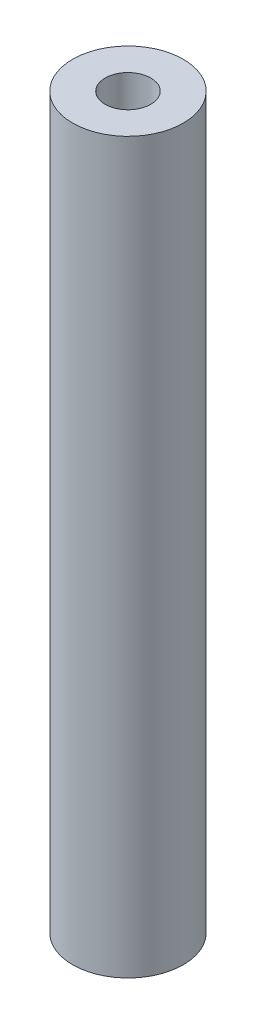
ISO-10303-21;
HEADER;
FILE_DESCRIPTION(('STEP AP214'),'2;1');
FILE_NAME('part.step','',(''),(''),'','','');
FILE_SCHEMA(('AUTOMOTIVE_DESIGN { 1 0 10303 214 1 1 1 1 }'));
ENDSEC;
DATA;
#1=APPLICATION_CONTEXT('core data for automotive mechanical design processes');
#2=APPLICATION_PROTOCOL_DEFINITION('international standard','automotive_design',2000,#1);
#3=PRODUCT_CONTEXT('',#1,'mechanical');
#4=PRODUCT('Part','Part','',(#3));
#5=PRODUCT_RELATED_PRODUCT_CATEGORY('part','',(#4));
#6=PRODUCT_DEFINITION_FORMATION('','',#4);
#7=PRODUCT_DEFINITION_CONTEXT('part definition',#1,'design');
#8=PRODUCT_DEFINITION('design','',#6,#7);
#9=PRODUCT_DEFINITION_SHAPE('','',#8);
#10=(LENGTH_UNIT() NAMED_UNIT(*) SI_UNIT(.MILLI.,.METRE.));
#11=(NAMED_UNIT(*) PLANE_ANGLE_UNIT() SI_UNIT($,.RADIAN.));
#12=(NAMED_UNIT(*) SI_UNIT($,.STERADIAN.) SOLID_ANGLE_UNIT());
#13=UNCERTAINTY_MEASURE_WITH_UNIT(LENGTH_MEASURE(1.E-05),#10,'distance_accuracy_value','');
#14=(GEOMETRIC_REPRESENTATION_CONTEXT(3) GLOBAL_UNCERTAINTY_ASSIGNED_CONTEXT((#13)) GLOBAL_UNIT_ASSIGNED_CONTEXT((#10,
#11,#12)) REPRESENTATION_CONTEXT('',''));
#15=CARTESIAN_POINT('',(0.,0.,0.));
#16=DIRECTION('',(0.,0.,1.));
#17=DIRECTION('',(1.,0.,0.));
#18=AXIS2_PLACEMENT_3D('',#15,#16,#17);
#19=CARTESIAN_POINT('',(0.,26.35,0.));
#20=DIRECTION('',(0.,-1.,0.));
#21=DIRECTION('',(0.,0.,-1.));
#22=AXIS2_PLACEMENT_3D('',#19,#20,#21);
#23=CYLINDRICAL_SURFACE('',#22,4.);
#24=CARTESIAN_POINT('',(0.,26.35,0.));
#25=DIRECTION('',(0.,1.,0.));
#26=DIRECTION('',(0.,0.,1.));
#27=AXIS2_PLACEMENT_3D('',#24,#25,#26);
#28=CIRCLE('',#27,4.);
#29=CARTESIAN_POINT('',(0.,26.35,4.));
#30=VERTEX_POINT('',#29);
#31=EDGE_CURVE('E11',#30,#30,#28,.T.);
#32=ORIENTED_EDGE('',*,*,#31,.F.);
#33=EDGE_LOOP('',(#32));
#34=FACE_BOUND('',#33,.T.);
#35=CARTESIAN_POINT('',(0.,-26.35,0.));
#36=DIRECTION('',(0.,1.,0.));
#37=DIRECTION('',(0.,0.,1.));
#38=AXIS2_PLACEMENT_3D('',#35,#36,#37);
#39=CIRCLE('',#38,4.);
#40=CARTESIAN_POINT('',(0.,-26.35,4.));
#41=VERTEX_POINT('',#40);
#42=EDGE_CURVE('E58',#41,#41,#39,.T.);
#43=ORIENTED_EDGE('',*,*,#42,.T.);
#44=EDGE_LOOP('',(#43));
#45=FACE_BOUND('',#44,.T.);
#46=ADVANCED_FACE('F55',(#34,#45),#23,.T.);
#47=CARTESIAN_POINT('',(0.,26.35,0.));
#48=DIRECTION('',(0.,1.,0.));
#49=DIRECTION('',(0.,0.,1.));
#50=AXIS2_PLACEMENT_3D('',#47,#48,#49);
#51=PLANE('',#50);
#52=CARTESIAN_POINT('',(0.,26.35,0.));
#53=DIRECTION('',(0.,1.,0.));
#54=DIRECTION('',(0.,0.,1.));
#55=AXIS2_PLACEMENT_3D('',#52,#53,#54);
#56=CIRCLE('',#55,1.64999999999999);
#57=CARTESIAN_POINT('',(0.,26.35,1.64999999999999));
#58=VERTEX_POINT('',#57);
#59=EDGE_CURVE('E78',#58,#58,#56,.T.);
#60=ORIENTED_EDGE('',*,*,#59,.F.);
#61=EDGE_LOOP('',(#60));
#62=FACE_BOUND('',#61,.T.);
#63=ORIENTED_EDGE('',*,*,#31,.T.);
#64=EDGE_LOOP('',(#63));
#65=FACE_BOUND('',#64,.T.);
#66=ADVANCED_FACE('F97',(#62,#65),#51,.T.);
#67=CARTESIAN_POINT('',(0.,-26.35,0.));
#68=DIRECTION('',(0.,1.,0.));
#69=DIRECTION('',(0.,0.,1.));
#70=AXIS2_PLACEMENT_3D('',#67,#68,#69);
#71=PLANE('',#70);
#72=CARTESIAN_POINT('',(0.,-26.35,0.));
#73=DIRECTION('',(0.,-1.,0.));
#74=DIRECTION('',(0.,0.,-1.));
#75=AXIS2_PLACEMENT_3D('',#72,#73,#74);
#76=CIRCLE('',#75,1.64999999999999);
#77=CARTESIAN_POINT('',(0.,-26.35,-1.64999999999999));
#78=VERTEX_POINT('',#77);
#79=EDGE_CURVE('E79',#78,#78,#76,.T.);
#80=ORIENTED_EDGE('',*,*,#79,.F.);
#81=EDGE_LOOP('',(#80));
#82=FACE_BOUND('',#81,.T.);
#83=ORIENTED_EDGE('',*,*,#42,.F.);
#84=EDGE_LOOP('',(#83));
#85=FACE_BOUND('',#84,.T.);
#86=ADVANCED_FACE('F94',(#82,#85),#71,.F.);
#87=CARTESIAN_POINT('',(0.,11.35,0.));
#88=DIRECTION('',(0.,1.,0.));
#89=DIRECTION('',(0.,0.,1.));
#90=AXIS2_PLACEMENT_3D('',#87,#88,#89);
#91=CONICAL_SURFACE('',#90,1.65,1.02974425867665);
#92=CARTESIAN_POINT('',(0.,10.3585799786045,0.));
#93=VERTEX_POINT('',#92);
#94=VERTEX_LOOP('',#93);
#95=FACE_BOUND('',#94,.T.);
#96=CARTESIAN_POINT('',(0.,11.35,0.));
#97=DIRECTION('',(0.,1.,0.));
#98=DIRECTION('',(0.,0.,1.));
#99=AXIS2_PLACEMENT_3D('',#96,#97,#98);
#100=CIRCLE('',#99,1.65);
#101=CARTESIAN_POINT('',(0.,11.35,1.65));
#102=VERTEX_POINT('',#101);
#103=EDGE_CURVE('E82',#102,#102,#100,.T.);
#104=ORIENTED_EDGE('',*,*,#103,.T.);
#105=EDGE_LOOP('',(#104));
#106=FACE_BOUND('',#105,.T.);
#107=ADVANCED_FACE('F96',(#95,#106),#91,.F.);
#108=CARTESIAN_POINT('',(0.,26.35,0.));
#109=DIRECTION('',(0.,1.,0.));
#110=DIRECTION('',(0.,0.,1.));
#111=AXIS2_PLACEMENT_3D('',#108,#109,#110);
#112=CYLINDRICAL_SURFACE('',#111,1.64999999999999);
#113=ORIENTED_EDGE('',*,*,#103,.F.);
#114=EDGE_LOOP('',(#113));
#115=FACE_BOUND('',#114,.T.);
#116=ORIENTED_EDGE('',*,*,#59,.T.);
#117=EDGE_LOOP('',(#116));
#118=FACE_BOUND('',#117,.T.);
#119=ADVANCED_FACE('F72',(#115,#118),#112,.F.);
#120=CARTESIAN_POINT('',(0.,-11.35,0.));
#121=DIRECTION('',(0.,-1.,0.));
#122=DIRECTION('',(0.,0.,-1.));
#123=AXIS2_PLACEMENT_3D('',#120,#121,#122);
#124=CONICAL_SURFACE('',#123,1.64999999999999,1.02974425867665);
#125=CARTESIAN_POINT('',(0.,-10.3585799786045,0.));
#126=VERTEX_POINT('',#125);
#127=VERTEX_LOOP('',#126);
#128=FACE_BOUND('',#127,.T.);
#129=CARTESIAN_POINT('',(0.,-11.35,0.));
#130=DIRECTION('',(0.,-1.,0.));
#131=DIRECTION('',(0.,0.,-1.));
#132=AXIS2_PLACEMENT_3D('',#129,#130,#131);
#133=CIRCLE('',#132,1.64999999999999);
#134=CARTESIAN_POINT('',(0.,-11.35,-1.64999999999999));
#135=VERTEX_POINT('',#134);
#136=EDGE_CURVE('E76',#135,#135,#133,.T.);
#137=ORIENTED_EDGE('',*,*,#136,.T.);
#138=EDGE_LOOP('',(#137));
#139=FACE_BOUND('',#138,.T.);
#140=ADVANCED_FACE('F68',(#128,#139),#124,.F.);
#141=CARTESIAN_POINT('',(0.,-26.35,0.));
#142=DIRECTION('',(0.,-1.,0.));
#143=DIRECTION('',(0.,0.,-1.));
#144=AXIS2_PLACEMENT_3D('',#141,#142,#143);
#145=CYLINDRICAL_SURFACE('',#144,1.64999999999999);
#146=ORIENTED_EDGE('',*,*,#136,.F.);
#147=EDGE_LOOP('',(#146));
#148=FACE_BOUND('',#147,.T.);
#149=ORIENTED_EDGE('',*,*,#79,.T.);
#150=EDGE_LOOP('',(#149));
#151=FACE_BOUND('',#150,.T.);
#152=ADVANCED_FACE('F71',(#148,#151),#145,.F.);
#153=CLOSED_SHELL('',(#46,#66,#86,#107,#119,#140,#152));
#154=MANIFOLD_SOLID_BREP('B2',#153);
#155=ADVANCED_BREP_SHAPE_REPRESENTATION('',(#18,#154),#14);
#156=SHAPE_DEFINITION_REPRESENTATION(#9,#155);
ENDSEC;
END-ISO-10303-21;
